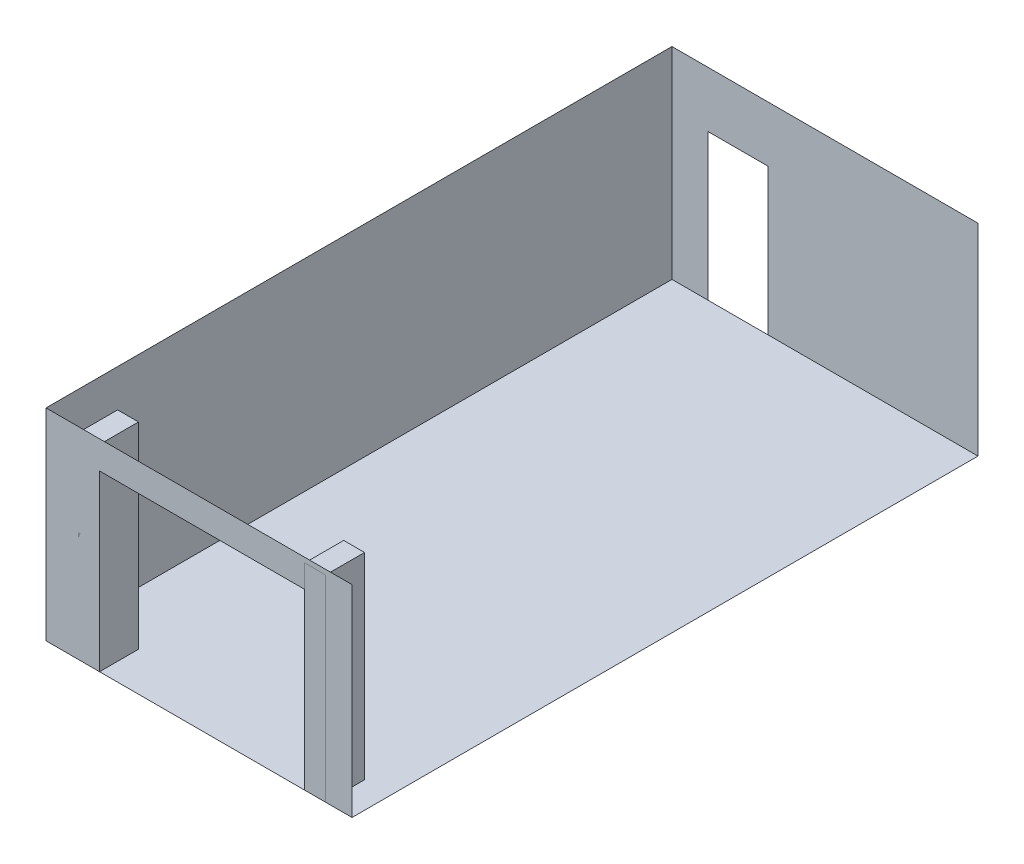
ISO-10303-21;
HEADER;
FILE_DESCRIPTION(('STEP AP214'),'2;1');
FILE_NAME('part.step','',(''),(''),'','','');
FILE_SCHEMA(('AUTOMOTIVE_DESIGN { 1 0 10303 214 1 1 1 1 }'));
ENDSEC;
DATA;
#1=APPLICATION_CONTEXT('core data for automotive mechanical design processes');
#2=APPLICATION_PROTOCOL_DEFINITION('international standard','automotive_design',2000,#1);
#3=PRODUCT_CONTEXT('',#1,'mechanical');
#4=PRODUCT('Part','Part','',(#3));
#5=PRODUCT_RELATED_PRODUCT_CATEGORY('part','',(#4));
#6=PRODUCT_DEFINITION_FORMATION('','',#4);
#7=PRODUCT_DEFINITION_CONTEXT('part definition',#1,'design');
#8=PRODUCT_DEFINITION('design','',#6,#7);
#9=PRODUCT_DEFINITION_SHAPE('','',#8);
#10=(LENGTH_UNIT() NAMED_UNIT(*) SI_UNIT(.MILLI.,.METRE.));
#11=(NAMED_UNIT(*) PLANE_ANGLE_UNIT() SI_UNIT($,.RADIAN.));
#12=(NAMED_UNIT(*) SI_UNIT($,.STERADIAN.) SOLID_ANGLE_UNIT());
#13=UNCERTAINTY_MEASURE_WITH_UNIT(LENGTH_MEASURE(1.E-05),#10,'distance_accuracy_value','');
#14=(GEOMETRIC_REPRESENTATION_CONTEXT(3) GLOBAL_UNCERTAINTY_ASSIGNED_CONTEXT((#13)) GLOBAL_UNIT_ASSIGNED_CONTEXT((#10,
#11,#12)) REPRESENTATION_CONTEXT('',''));
#15=CARTESIAN_POINT('',(0.,0.,0.));
#16=DIRECTION('',(0.,0.,1.));
#17=DIRECTION('',(1.,0.,0.));
#18=AXIS2_PLACEMENT_3D('',#15,#16,#17);
#19=CARTESIAN_POINT('',(3720.,0.,-560.));
#20=DIRECTION('',(0.,-1.,0.));
#21=DIRECTION('',(1.,0.,0.));
#22=AXIS2_PLACEMENT_3D('',#19,#20,#21);
#23=PLANE('',#22);
#24=DIRECTION('',(1.,0.,0.));
#25=VECTOR('',#24,1.);
#26=CARTESIAN_POINT('',(3720.,0.,0.));
#27=LINE('',#26,#25);
#28=CARTESIAN_POINT('',(3720.,0.,0.));
#29=VERTEX_POINT('',#28);
#30=CARTESIAN_POINT('',(4020.,0.,0.));
#31=VERTEX_POINT('',#30);
#32=EDGE_CURVE('E118',#29,#31,#27,.T.);
#33=ORIENTED_EDGE('',*,*,#32,.F.);
#34=DIRECTION('',(0.,0.,1.));
#35=VECTOR('',#34,1.);
#36=CARTESIAN_POINT('',(3720.,0.,-560.));
#37=LINE('',#36,#35);
#38=CARTESIAN_POINT('',(3720.,0.,-560.));
#39=VERTEX_POINT('',#38);
#40=EDGE_CURVE('E12',#39,#29,#37,.T.);
#41=ORIENTED_EDGE('',*,*,#40,.F.);
#42=DIRECTION('',(1.,0.,0.));
#43=VECTOR('',#42,1.);
#44=CARTESIAN_POINT('',(3720.,0.,-560.));
#45=LINE('',#44,#43);
#46=CARTESIAN_POINT('',(4020.,0.,-560.));
#47=VERTEX_POINT('',#46);
#48=EDGE_CURVE('E113',#39,#47,#45,.T.);
#49=ORIENTED_EDGE('',*,*,#48,.T.);
#50=DIRECTION('',(0.,0.,1.));
#51=VECTOR('',#50,1.);
#52=CARTESIAN_POINT('',(4020.,0.,-560.));
#53=LINE('',#52,#51);
#54=EDGE_CURVE('E57',#47,#31,#53,.T.);
#55=ORIENTED_EDGE('',*,*,#54,.T.);
#56=EDGE_LOOP('',(#33,#41,#49,#55));
#57=FACE_BOUND('',#56,.T.);
#58=ADVANCED_FACE('F54',(#57),#23,.T.);
#59=CARTESIAN_POINT('',(3720.,0.,-560.));
#60=DIRECTION('',(-1.,0.,0.));
#61=DIRECTION('',(0.,0.,1.));
#62=AXIS2_PLACEMENT_3D('',#59,#60,#61);
#63=PLANE('',#62);
#64=DIRECTION('',(0.,-1.,0.));
#65=VECTOR('',#64,1.);
#66=CARTESIAN_POINT('',(3720.,0.,0.));
#67=LINE('',#66,#65);
#68=CARTESIAN_POINT('',(3720.,2830.,0.));
#69=VERTEX_POINT('',#68);
#70=EDGE_CURVE('E85',#69,#29,#67,.T.);
#71=ORIENTED_EDGE('',*,*,#70,.F.);
#72=DIRECTION('',(0.,0.,1.));
#73=VECTOR('',#72,1.);
#74=CARTESIAN_POINT('',(3720.,2830.,-560.));
#75=LINE('',#74,#73);
#76=CARTESIAN_POINT('',(3720.,2830.,-560.));
#77=VERTEX_POINT('',#76);
#78=EDGE_CURVE('E63',#77,#69,#75,.T.);
#79=ORIENTED_EDGE('',*,*,#78,.F.);
#80=DIRECTION('',(0.,-1.,0.));
#81=VECTOR('',#80,1.);
#82=CARTESIAN_POINT('',(3720.,2500.,-560.));
#83=LINE('',#82,#81);
#84=EDGE_CURVE('E71',#77,#39,#83,.T.);
#85=ORIENTED_EDGE('',*,*,#84,.T.);
#86=ORIENTED_EDGE('',*,*,#40,.T.);
#87=EDGE_LOOP('',(#71,#79,#85,#86));
#88=FACE_BOUND('',#87,.T.);
#89=ADVANCED_FACE('F129',(#88),#63,.T.);
#90=CARTESIAN_POINT('',(3720.,2830.,-560.));
#91=DIRECTION('',(0.,1.,0.));
#92=DIRECTION('',(0.,0.,1.));
#93=AXIS2_PLACEMENT_3D('',#90,#91,#92);
#94=PLANE('',#93);
#95=DIRECTION('',(-1.,0.,0.));
#96=VECTOR('',#95,1.);
#97=CARTESIAN_POINT('',(3720.,2830.,0.));
#98=LINE('',#97,#96);
#99=CARTESIAN_POINT('',(4020.,2830.,0.));
#100=VERTEX_POINT('',#99);
#101=EDGE_CURVE('E104',#100,#69,#98,.T.);
#102=ORIENTED_EDGE('',*,*,#101,.F.);
#103=DIRECTION('',(0.,0.,1.));
#104=VECTOR('',#103,1.);
#105=CARTESIAN_POINT('',(4020.,2830.,-560.));
#106=LINE('',#105,#104);
#107=CARTESIAN_POINT('',(4020.,2830.,-560.));
#108=VERTEX_POINT('',#107);
#109=EDGE_CURVE('E99',#108,#100,#106,.T.);
#110=ORIENTED_EDGE('',*,*,#109,.F.);
#111=DIRECTION('',(-1.,0.,0.));
#112=VECTOR('',#111,1.);
#113=CARTESIAN_POINT('',(3720.,2830.,-560.));
#114=LINE('',#113,#112);
#115=EDGE_CURVE('E102',#108,#77,#114,.T.);
#116=ORIENTED_EDGE('',*,*,#115,.T.);
#117=ORIENTED_EDGE('',*,*,#78,.T.);
#118=EDGE_LOOP('',(#102,#110,#116,#117));
#119=FACE_BOUND('',#118,.T.);
#120=ADVANCED_FACE('F101',(#119),#94,.T.);
#121=CARTESIAN_POINT('',(4020.,0.,-560.));
#122=DIRECTION('',(1.,0.,0.));
#123=DIRECTION('',(0.,0.,-1.));
#124=AXIS2_PLACEMENT_3D('',#121,#122,#123);
#125=PLANE('',#124);
#126=DIRECTION('',(0.,1.,0.));
#127=VECTOR('',#126,1.);
#128=CARTESIAN_POINT('',(4020.,0.,0.));
#129=LINE('',#128,#127);
#130=EDGE_CURVE('E121',#31,#100,#129,.T.);
#131=ORIENTED_EDGE('',*,*,#130,.F.);
#132=ORIENTED_EDGE('',*,*,#54,.F.);
#133=DIRECTION('',(0.,1.,0.));
#134=VECTOR('',#133,1.);
#135=CARTESIAN_POINT('',(4020.,0.,-560.));
#136=LINE('',#135,#134);
#137=EDGE_CURVE('E109',#47,#108,#136,.T.);
#138=ORIENTED_EDGE('',*,*,#137,.T.);
#139=ORIENTED_EDGE('',*,*,#109,.T.);
#140=EDGE_LOOP('',(#131,#132,#138,#139));
#141=FACE_BOUND('',#140,.T.);
#142=ADVANCED_FACE('F112',(#141),#125,.T.);
#143=CARTESIAN_POINT('',(0.,0.,-560.));
#144=DIRECTION('',(0.,0.,1.));
#145=DIRECTION('',(1.,0.,0.));
#146=AXIS2_PLACEMENT_3D('',#143,#144,#145);
#147=PLANE('',#146);
#148=ORIENTED_EDGE('',*,*,#48,.F.);
#149=ORIENTED_EDGE('',*,*,#84,.F.);
#150=ORIENTED_EDGE('',*,*,#115,.F.);
#151=ORIENTED_EDGE('',*,*,#137,.F.);
#152=EDGE_LOOP('',(#148,#149,#150,#151));
#153=FACE_BOUND('',#152,.T.);
#154=ADVANCED_FACE('F108',(#153),#147,.F.);
#155=CARTESIAN_POINT('',(0.,0.,0.));
#156=DIRECTION('',(0.,0.,1.));
#157=DIRECTION('',(1.,0.,0.));
#158=AXIS2_PLACEMENT_3D('',#155,#156,#157);
#159=PLANE('',#158);
#160=ORIENTED_EDGE('',*,*,#32,.T.);
#161=ORIENTED_EDGE('',*,*,#130,.T.);
#162=ORIENTED_EDGE('',*,*,#101,.T.);
#163=ORIENTED_EDGE('',*,*,#70,.T.);
#164=EDGE_LOOP('',(#160,#161,#162,#163));
#165=FACE_BOUND('',#164,.T.);
#166=ADVANCED_FACE('F126',(#165),#159,.T.);
#167=CLOSED_SHELL('',(#58,#89,#120,#142,#154,#166));
#168=MANIFOLD_SOLID_BREP('B2',#167);
#169=CARTESIAN_POINT('',(470.,0.,-560.));
#170=DIRECTION('',(-1.,0.,0.));
#171=DIRECTION('',(0.,0.,1.));
#172=AXIS2_PLACEMENT_3D('',#169,#170,#171);
#173=PLANE('',#172);
#174=DIRECTION('',(0.,-1.,0.));
#175=VECTOR('',#174,1.);
#176=CARTESIAN_POINT('',(470.,0.,0.));
#177=LINE('',#176,#175);
#178=CARTESIAN_POINT('',(470.,2830.,0.));
#179=VERTEX_POINT('',#178);
#180=CARTESIAN_POINT('',(470.,0.,0.));
#181=VERTEX_POINT('',#180);
#182=EDGE_CURVE('E255',#179,#181,#177,.T.);
#183=ORIENTED_EDGE('',*,*,#182,.F.);
#184=DIRECTION('',(0.,0.,1.));
#185=VECTOR('',#184,1.);
#186=CARTESIAN_POINT('',(470.,2830.,-560.));
#187=LINE('',#186,#185);
#188=CARTESIAN_POINT('',(470.,2830.,-560.));
#189=VERTEX_POINT('',#188);
#190=EDGE_CURVE('E52',#189,#179,#187,.T.);
#191=ORIENTED_EDGE('',*,*,#190,.F.);
#192=DIRECTION('',(0.,-1.,0.));
#193=VECTOR('',#192,1.);
#194=CARTESIAN_POINT('',(470.,0.,-560.));
#195=LINE('',#194,#193);
#196=CARTESIAN_POINT('',(470.,0.,-560.));
#197=VERTEX_POINT('',#196);
#198=EDGE_CURVE('E249',#189,#197,#195,.T.);
#199=ORIENTED_EDGE('',*,*,#198,.T.);
#200=DIRECTION('',(0.,0.,1.));
#201=VECTOR('',#200,1.);
#202=CARTESIAN_POINT('',(470.,0.,-560.));
#203=LINE('',#202,#201);
#204=EDGE_CURVE('E194',#197,#181,#203,.T.);
#205=ORIENTED_EDGE('',*,*,#204,.T.);
#206=EDGE_LOOP('',(#183,#191,#199,#205));
#207=FACE_BOUND('',#206,.T.);
#208=ADVANCED_FACE('F191',(#207),#173,.T.);
#209=CARTESIAN_POINT('',(470.,2830.,-560.));
#210=DIRECTION('',(0.,1.,0.));
#211=DIRECTION('',(0.,0.,1.));
#212=AXIS2_PLACEMENT_3D('',#209,#210,#211);
#213=PLANE('',#212);
#214=DIRECTION('',(-1.,0.,0.));
#215=VECTOR('',#214,1.);
#216=CARTESIAN_POINT('',(470.,2830.,0.));
#217=LINE('',#216,#215);
#218=CARTESIAN_POINT('',(770.,2830.,0.));
#219=VERTEX_POINT('',#218);
#220=EDGE_CURVE('E251',#219,#179,#217,.T.);
#221=ORIENTED_EDGE('',*,*,#220,.F.);
#222=DIRECTION('',(0.,0.,1.));
#223=VECTOR('',#222,1.);
#224=CARTESIAN_POINT('',(770.,2830.,-560.));
#225=LINE('',#224,#223);
#226=CARTESIAN_POINT('',(770.,2830.,-560.));
#227=VERTEX_POINT('',#226);
#228=EDGE_CURVE('E200',#227,#219,#225,.T.);
#229=ORIENTED_EDGE('',*,*,#228,.F.);
#230=DIRECTION('',(-1.,0.,0.));
#231=VECTOR('',#230,1.);
#232=CARTESIAN_POINT('',(470.,2830.,-560.));
#233=LINE('',#232,#231);
#234=EDGE_CURVE('E246',#227,#189,#233,.T.);
#235=ORIENTED_EDGE('',*,*,#234,.T.);
#236=ORIENTED_EDGE('',*,*,#190,.T.);
#237=EDGE_LOOP('',(#221,#229,#235,#236));
#238=FACE_BOUND('',#237,.T.);
#239=ADVANCED_FACE('F265',(#238),#213,.T.);
#240=CARTESIAN_POINT('',(770.,2500.,-560.));
#241=DIRECTION('',(1.,0.,0.));
#242=DIRECTION('',(0.,0.,-1.));
#243=AXIS2_PLACEMENT_3D('',#240,#241,#242);
#244=PLANE('',#243);
#245=DIRECTION('',(0.,1.,0.));
#246=VECTOR('',#245,1.);
#247=CARTESIAN_POINT('',(770.,2500.,0.));
#248=LINE('',#247,#246);
#249=CARTESIAN_POINT('',(770.,-3.82072635824906E-13,0.));
#250=VERTEX_POINT('',#249);
#251=EDGE_CURVE('E240',#250,#219,#248,.T.);
#252=ORIENTED_EDGE('',*,*,#251,.F.);
#253=DIRECTION('',(0.,0.,1.));
#254=VECTOR('',#253,1.);
#255=CARTESIAN_POINT('',(770.,-3.82072635824906E-13,-560.));
#256=LINE('',#255,#254);
#257=CARTESIAN_POINT('',(770.,-3.82072635824906E-13,-560.));
#258=VERTEX_POINT('',#257);
#259=EDGE_CURVE('E236',#258,#250,#256,.T.);
#260=ORIENTED_EDGE('',*,*,#259,.F.);
#261=DIRECTION('',(0.,1.,0.));
#262=VECTOR('',#261,1.);
#263=CARTESIAN_POINT('',(770.,-3.82072635824906E-13,-560.));
#264=LINE('',#263,#262);
#265=EDGE_CURVE('E239',#258,#227,#264,.T.);
#266=ORIENTED_EDGE('',*,*,#265,.T.);
#267=ORIENTED_EDGE('',*,*,#228,.T.);
#268=EDGE_LOOP('',(#252,#260,#266,#267));
#269=FACE_BOUND('',#268,.T.);
#270=ADVANCED_FACE('F238',(#269),#244,.T.);
#271=CARTESIAN_POINT('',(470.,0.,-560.));
#272=DIRECTION('',(0.,-1.,0.));
#273=DIRECTION('',(1.,0.,0.));
#274=AXIS2_PLACEMENT_3D('',#271,#272,#273);
#275=PLANE('',#274);
#276=DIRECTION('',(1.,0.,0.));
#277=VECTOR('',#276,1.);
#278=CARTESIAN_POINT('',(470.,0.,0.));
#279=LINE('',#278,#277);
#280=EDGE_CURVE('E258',#181,#250,#279,.T.);
#281=ORIENTED_EDGE('',*,*,#280,.F.);
#282=ORIENTED_EDGE('',*,*,#204,.F.);
#283=DIRECTION('',(1.,0.,0.));
#284=VECTOR('',#283,1.);
#285=CARTESIAN_POINT('',(470.,0.,-560.));
#286=LINE('',#285,#284);
#287=EDGE_CURVE('E245',#197,#258,#286,.T.);
#288=ORIENTED_EDGE('',*,*,#287,.T.);
#289=ORIENTED_EDGE('',*,*,#259,.T.);
#290=EDGE_LOOP('',(#281,#282,#288,#289));
#291=FACE_BOUND('',#290,.T.);
#292=ADVANCED_FACE('F248',(#291),#275,.T.);
#293=CARTESIAN_POINT('',(0.,0.,-560.));
#294=DIRECTION('',(0.,0.,-1.));
#295=DIRECTION('',(-1.,0.,0.));
#296=AXIS2_PLACEMENT_3D('',#293,#294,#295);
#297=PLANE('',#296);
#298=ORIENTED_EDGE('',*,*,#198,.F.);
#299=ORIENTED_EDGE('',*,*,#234,.F.);
#300=ORIENTED_EDGE('',*,*,#265,.F.);
#301=ORIENTED_EDGE('',*,*,#287,.F.);
#302=EDGE_LOOP('',(#298,#299,#300,#301));
#303=FACE_BOUND('',#302,.T.);
#304=ADVANCED_FACE('F244',(#303),#297,.T.);
#305=CARTESIAN_POINT('',(0.,0.,0.));
#306=DIRECTION('',(0.,0.,-1.));
#307=DIRECTION('',(-1.,0.,0.));
#308=AXIS2_PLACEMENT_3D('',#305,#306,#307);
#309=PLANE('',#308);
#310=ORIENTED_EDGE('',*,*,#182,.T.);
#311=ORIENTED_EDGE('',*,*,#280,.T.);
#312=ORIENTED_EDGE('',*,*,#251,.T.);
#313=ORIENTED_EDGE('',*,*,#220,.T.);
#314=EDGE_LOOP('',(#310,#311,#312,#313));
#315=FACE_BOUND('',#314,.T.);
#316=ADVANCED_FACE('F264',(#315),#309,.F.);
#317=CLOSED_SHELL('',(#208,#239,#270,#292,#304,#316));
#318=MANIFOLD_SOLID_BREP('B6',#317);
#319=CARTESIAN_POINT('',(0.,0.,0.));
#320=DIRECTION('',(-1.,0.,0.));
#321=DIRECTION('',(0.,0.,1.));
#322=AXIS2_PLACEMENT_3D('',#319,#320,#321);
#323=PLANE('',#322);
#324=DIRECTION('',(0.,-1.,0.));
#325=VECTOR('',#324,1.);
#326=CARTESIAN_POINT('',(0.,0.,0.));
#327=LINE('',#326,#325);
#328=CARTESIAN_POINT('',(0.,2900.,0.));
#329=VERTEX_POINT('',#328);
#330=CARTESIAN_POINT('',(0.,0.,0.));
#331=VERTEX_POINT('',#330);
#332=EDGE_CURVE('E348',#329,#331,#327,.T.);
#333=ORIENTED_EDGE('',*,*,#332,.F.);
#334=DIRECTION('',(0.,0.,1.));
#335=VECTOR('',#334,1.);
#336=CARTESIAN_POINT('',(0.,2900.,-9000.));
#337=LINE('',#336,#335);
#338=CARTESIAN_POINT('',(0.,2900.,-9000.));
#339=VERTEX_POINT('',#338);
#340=EDGE_CURVE('E189',#339,#329,#337,.T.);
#341=ORIENTED_EDGE('',*,*,#340,.F.);
#342=DIRECTION('',(0.,-1.,0.));
#343=VECTOR('',#342,1.);
#344=CARTESIAN_POINT('',(0.,0.,-9000.));
#345=LINE('',#344,#343);
#346=CARTESIAN_POINT('',(0.,0.,-9000.));
#347=VERTEX_POINT('',#346);
#348=EDGE_CURVE('E333',#339,#347,#345,.T.);
#349=ORIENTED_EDGE('',*,*,#348,.T.);
#350=DIRECTION('',(0.,0.,1.));
#351=VECTOR('',#350,1.);
#352=CARTESIAN_POINT('',(0.,0.,-9000.));
#353=LINE('',#352,#351);
#354=EDGE_CURVE('E346',#347,#331,#353,.T.);
#355=ORIENTED_EDGE('',*,*,#354,.T.);
#356=EDGE_LOOP('',(#333,#341,#349,#355));
#357=FACE_BOUND('',#356,.T.);
#358=ADVANCED_FACE('F328',(#357),#323,.T.);
#359=OPEN_SHELL('',(#358));
#360=SHELL_BASED_SURFACE_MODEL('B46',(#359));
#361=CARTESIAN_POINT('',(0.,0.,0.));
#362=DIRECTION('',(0.,-1.,0.));
#363=DIRECTION('',(0.,0.,-1.));
#364=AXIS2_PLACEMENT_3D('',#361,#362,#363);
#365=PLANE('',#364);
#366=DIRECTION('',(1.,0.,0.));
#367=VECTOR('',#366,1.);
#368=CARTESIAN_POINT('',(0.,0.,0.));
#369=LINE('',#368,#367);
#370=CARTESIAN_POINT('',(0.,0.,0.));
#371=VERTEX_POINT('',#370);
#372=CARTESIAN_POINT('',(4400.,0.,0.));
#373=VERTEX_POINT('',#372);
#374=EDGE_CURVE('E416',#371,#373,#369,.T.);
#375=ORIENTED_EDGE('',*,*,#374,.F.);
#376=DIRECTION('',(0.,0.,1.));
#377=VECTOR('',#376,1.);
#378=CARTESIAN_POINT('',(0.,0.,-9000.));
#379=LINE('',#378,#377);
#380=CARTESIAN_POINT('',(0.,0.,-9000.));
#381=VERTEX_POINT('',#380);
#382=EDGE_CURVE('E326',#381,#371,#379,.T.);
#383=ORIENTED_EDGE('',*,*,#382,.F.);
#384=DIRECTION('',(1.,0.,0.));
#385=VECTOR('',#384,1.);
#386=CARTESIAN_POINT('',(0.,0.,-9000.));
#387=LINE('',#386,#385);
#388=CARTESIAN_POINT('',(4400.,0.,-9000.));
#389=VERTEX_POINT('',#388);
#390=EDGE_CURVE('E401',#381,#389,#387,.T.);
#391=ORIENTED_EDGE('',*,*,#390,.T.);
#392=DIRECTION('',(0.,0.,1.));
#393=VECTOR('',#392,1.);
#394=CARTESIAN_POINT('',(4400.,0.,-9000.));
#395=LINE('',#394,#393);
#396=EDGE_CURVE('E414',#389,#373,#395,.T.);
#397=ORIENTED_EDGE('',*,*,#396,.T.);
#398=EDGE_LOOP('',(#375,#383,#391,#397));
#399=FACE_BOUND('',#398,.T.);
#400=ADVANCED_FACE('F396',(#399),#365,.T.);
#401=OPEN_SHELL('',(#400));
#402=SHELL_BASED_SURFACE_MODEL('B183',(#401));
#403=CARTESIAN_POINT('',(0.,0.,-9000.));
#404=DIRECTION('',(0.,0.,1.));
#405=DIRECTION('',(1.,0.,0.));
#406=AXIS2_PLACEMENT_3D('',#403,#404,#405);
#407=PLANE('',#406);
#408=DIRECTION('',(0.,1.,0.));
#409=VECTOR('',#408,1.);
#410=CARTESIAN_POINT('',(1380.,0.,-9000.));
#411=LINE('',#410,#409);
#412=CARTESIAN_POINT('',(1380.,0.,-9000.));
#413=VERTEX_POINT('',#412);
#414=CARTESIAN_POINT('',(1380.,2100.,-9000.));
#415=VERTEX_POINT('',#414);
#416=EDGE_CURVE('E499',#413,#415,#411,.T.);
#417=ORIENTED_EDGE('',*,*,#416,.T.);
#418=DIRECTION('',(-1.,0.,0.));
#419=VECTOR('',#418,1.);
#420=CARTESIAN_POINT('',(0.,2100.,-9000.));
#421=LINE('',#420,#419);
#422=CARTESIAN_POINT('',(520.,2100.,-9000.));
#423=VERTEX_POINT('',#422);
#424=EDGE_CURVE('E394',#415,#423,#421,.T.);
#425=ORIENTED_EDGE('',*,*,#424,.T.);
#426=DIRECTION('',(0.,-1.,0.));
#427=VECTOR('',#426,1.);
#428=CARTESIAN_POINT('',(520.,0.,-9000.));
#429=LINE('',#428,#427);
#430=CARTESIAN_POINT('',(520.,0.,-9000.));
#431=VERTEX_POINT('',#430);
#432=EDGE_CURVE('E455',#423,#431,#429,.T.);
#433=ORIENTED_EDGE('',*,*,#432,.T.);
#434=DIRECTION('',(1.,0.,0.));
#435=VECTOR('',#434,1.);
#436=CARTESIAN_POINT('',(0.,0.,-9000.));
#437=LINE('',#436,#435);
#438=CARTESIAN_POINT('',(0.,0.,-9000.));
#439=VERTEX_POINT('',#438);
#440=EDGE_CURVE('E480',#439,#431,#437,.T.);
#441=ORIENTED_EDGE('',*,*,#440,.F.);
#442=DIRECTION('',(0.,-1.,0.));
#443=VECTOR('',#442,1.);
#444=CARTESIAN_POINT('',(0.,0.,-9000.));
#445=LINE('',#444,#443);
#446=CARTESIAN_POINT('',(0.,2900.,-9000.));
#447=VERTEX_POINT('',#446);
#448=EDGE_CURVE('E483',#447,#439,#445,.T.);
#449=ORIENTED_EDGE('',*,*,#448,.F.);
#450=DIRECTION('',(-1.,0.,0.));
#451=VECTOR('',#450,1.);
#452=CARTESIAN_POINT('',(0.,2900.,-9000.));
#453=LINE('',#452,#451);
#454=CARTESIAN_POINT('',(4400.,2900.,-9000.));
#455=VERTEX_POINT('',#454);
#456=EDGE_CURVE('E496',#455,#447,#453,.T.);
#457=ORIENTED_EDGE('',*,*,#456,.F.);
#458=DIRECTION('',(0.,1.,0.));
#459=VECTOR('',#458,1.);
#460=CARTESIAN_POINT('',(4400.,0.,-9000.));
#461=LINE('',#460,#459);
#462=CARTESIAN_POINT('',(4400.,0.,-9000.));
#463=VERTEX_POINT('',#462);
#464=EDGE_CURVE('E485',#463,#455,#461,.T.);
#465=ORIENTED_EDGE('',*,*,#464,.F.);
#466=EDGE_CURVE('E486',#413,#463,#437,.T.);
#467=ORIENTED_EDGE('',*,*,#466,.F.);
#468=EDGE_LOOP('',(#417,#425,#433,#441,#449,#457,#465,#467));
#469=FACE_BOUND('',#468,.T.);
#470=ADVANCED_FACE('F450',(#469),#407,.F.);
#471=OPEN_SHELL('',(#470));
#472=SHELL_BASED_SURFACE_MODEL('B320',(#471));
#473=CARTESIAN_POINT('',(0.,0.,0.));
#474=DIRECTION('',(0.,0.,1.));
#475=DIRECTION('',(1.,0.,0.));
#476=AXIS2_PLACEMENT_3D('',#473,#474,#475);
#477=PLANE('',#476);
#478=DIRECTION('',(1.,0.,0.));
#479=VECTOR('',#478,1.);
#480=CARTESIAN_POINT('',(0.,0.,0.));
#481=LINE('',#480,#479);
#482=CARTESIAN_POINT('',(0.,0.,0.));
#483=VERTEX_POINT('',#482);
#484=CARTESIAN_POINT('',(770.,0.,0.));
#485=VERTEX_POINT('',#484);
#486=EDGE_CURVE('E605',#483,#485,#481,.T.);
#487=ORIENTED_EDGE('',*,*,#486,.T.);
#488=DIRECTION('',(0.,-1.,0.));
#489=VECTOR('',#488,1.);
#490=CARTESIAN_POINT('',(770.,0.,0.));
#491=LINE('',#490,#489);
#492=CARTESIAN_POINT('',(770.,2500.,0.));
#493=VERTEX_POINT('',#492);
#494=EDGE_CURVE('E538',#493,#485,#491,.T.);
#495=ORIENTED_EDGE('',*,*,#494,.F.);
#496=DIRECTION('',(-1.,0.,0.));
#497=VECTOR('',#496,1.);
#498=CARTESIAN_POINT('',(-3.76346788008528E-13,2500.,0.));
#499=LINE('',#498,#497);
#500=CARTESIAN_POINT('',(3720.,2500.,0.));
#501=VERTEX_POINT('',#500);
#502=EDGE_CURVE('E598',#501,#493,#499,.T.);
#503=ORIENTED_EDGE('',*,*,#502,.F.);
#504=DIRECTION('',(0.,1.,0.));
#505=VECTOR('',#504,1.);
#506=CARTESIAN_POINT('',(3720.,0.,0.));
#507=LINE('',#506,#505);
#508=CARTESIAN_POINT('',(3720.,0.,0.));
#509=VERTEX_POINT('',#508);
#510=EDGE_CURVE('E630',#509,#501,#507,.T.);
#511=ORIENTED_EDGE('',*,*,#510,.F.);
#512=CARTESIAN_POINT('',(4400.,0.,0.));
#513=VERTEX_POINT('',#512);
#514=EDGE_CURVE('E626',#509,#513,#481,.T.);
#515=ORIENTED_EDGE('',*,*,#514,.T.);
#516=DIRECTION('',(0.,1.,0.));
#517=VECTOR('',#516,1.);
#518=CARTESIAN_POINT('',(4400.,0.,0.));
#519=LINE('',#518,#517);
#520=CARTESIAN_POINT('',(4400.,2900.,0.));
#521=VERTEX_POINT('',#520);
#522=EDGE_CURVE('E628',#513,#521,#519,.T.);
#523=ORIENTED_EDGE('',*,*,#522,.T.);
#524=DIRECTION('',(-1.,0.,0.));
#525=VECTOR('',#524,1.);
#526=CARTESIAN_POINT('',(0.,2900.,0.));
#527=LINE('',#526,#525);
#528=CARTESIAN_POINT('',(0.,2900.,0.));
#529=VERTEX_POINT('',#528);
#530=EDGE_CURVE('E634',#521,#529,#527,.T.);
#531=ORIENTED_EDGE('',*,*,#530,.T.);
#532=DIRECTION('',(0.,-1.,0.));
#533=VECTOR('',#532,1.);
#534=CARTESIAN_POINT('',(0.,0.,0.));
#535=LINE('',#534,#533);
#536=EDGE_CURVE('E640',#529,#483,#535,.T.);
#537=ORIENTED_EDGE('',*,*,#536,.T.);
#538=EDGE_LOOP('',(#487,#495,#503,#511,#515,#523,#531,#537));
#539=FACE_BOUND('',#538,.T.);
#540=ADVANCED_FACE('F593',(#539),#477,.T.);
#541=OPEN_SHELL('',(#540));
#542=SHELL_BASED_SURFACE_MODEL('B442',(#541));
#543=ADVANCED_BREP_SHAPE_REPRESENTATION('',(#18,#168,#318),#14);
#544=MANIFOLD_SURFACE_SHAPE_REPRESENTATION('',(#18,#360,#402,#472,#542),#14);
#545=SHAPE_REPRESENTATION('',(#18),#14);
#546=SHAPE_DEFINITION_REPRESENTATION(#9,#545);
#547=SHAPE_REPRESENTATION_RELATIONSHIP('','',#545,#543);
#548=SHAPE_REPRESENTATION_RELATIONSHIP('','',#545,#544);
ENDSEC;
END-ISO-10303-21;
